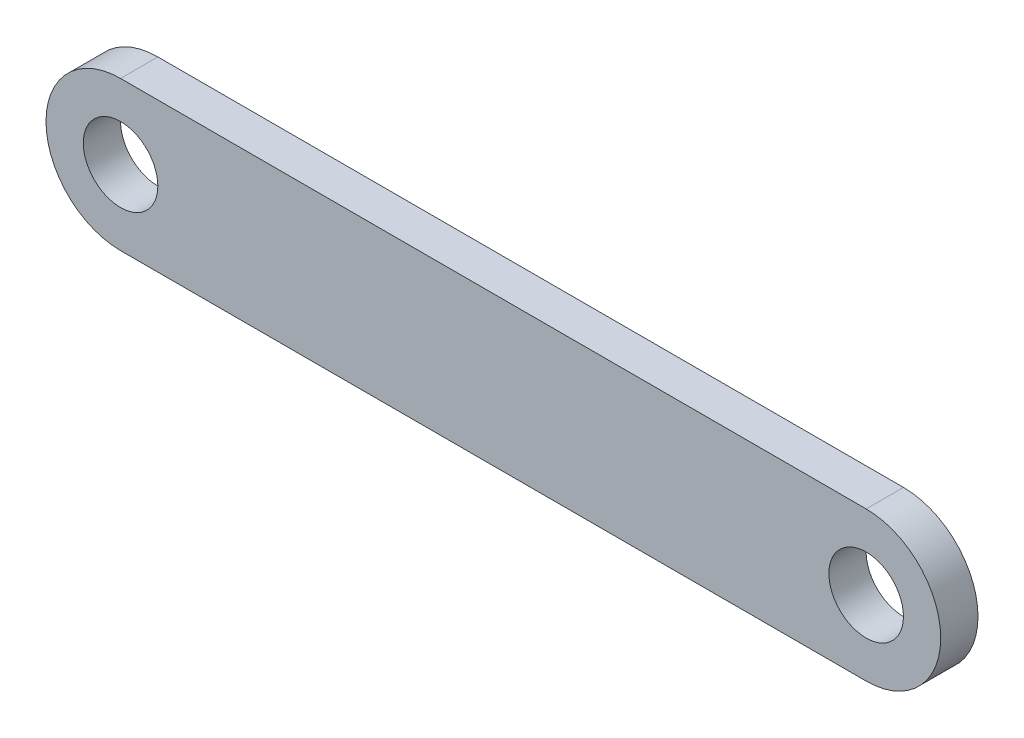
ISO-10303-21;
HEADER;
FILE_DESCRIPTION(('STEP AP214'),'2;1');
FILE_NAME('part.step','',(''),(''),'','','');
FILE_SCHEMA(('AUTOMOTIVE_DESIGN { 1 0 10303 214 1 1 1 1 }'));
ENDSEC;
DATA;
#1=APPLICATION_CONTEXT('core data for automotive mechanical design processes');
#2=APPLICATION_PROTOCOL_DEFINITION('international standard','automotive_design',2000,#1);
#3=PRODUCT_CONTEXT('',#1,'mechanical');
#4=PRODUCT('Part','Part','',(#3));
#5=PRODUCT_RELATED_PRODUCT_CATEGORY('part','',(#4));
#6=PRODUCT_DEFINITION_FORMATION('','',#4);
#7=PRODUCT_DEFINITION_CONTEXT('part definition',#1,'design');
#8=PRODUCT_DEFINITION('design','',#6,#7);
#9=PRODUCT_DEFINITION_SHAPE('','',#8);
#10=(LENGTH_UNIT() NAMED_UNIT(*) SI_UNIT(.MILLI.,.METRE.));
#11=(NAMED_UNIT(*) PLANE_ANGLE_UNIT() SI_UNIT($,.RADIAN.));
#12=(NAMED_UNIT(*) SI_UNIT($,.STERADIAN.) SOLID_ANGLE_UNIT());
#13=UNCERTAINTY_MEASURE_WITH_UNIT(LENGTH_MEASURE(1.E-05),#10,'distance_accuracy_value','');
#14=(GEOMETRIC_REPRESENTATION_CONTEXT(3) GLOBAL_UNCERTAINTY_ASSIGNED_CONTEXT((#13)) GLOBAL_UNIT_ASSIGNED_CONTEXT((#10,
#11,#12)) REPRESENTATION_CONTEXT('',''));
#15=CARTESIAN_POINT('',(0.,0.,0.));
#16=DIRECTION('',(0.,0.,1.));
#17=DIRECTION('',(1.,0.,0.));
#18=AXIS2_PLACEMENT_3D('',#15,#16,#17);
#19=CARTESIAN_POINT('',(-50.,0.,5.));
#20=DIRECTION('',(0.,0.,1.));
#21=DIRECTION('',(1.,0.,0.));
#22=AXIS2_PLACEMENT_3D('',#19,#20,#21);
#23=PLANE('',#22);
#24=CARTESIAN_POINT('',(-50.,0.,5.));
#25=DIRECTION('',(0.,0.,1.));
#26=DIRECTION('',(1.,0.,0.));
#27=AXIS2_PLACEMENT_3D('',#24,#25,#26);
#28=CIRCLE('',#27,5.);
#29=CARTESIAN_POINT('',(-45.,0.,5.));
#30=VERTEX_POINT('',#29);
#31=EDGE_CURVE('E112',#30,#30,#28,.T.);
#32=ORIENTED_EDGE('',*,*,#31,.F.);
#33=EDGE_LOOP('',(#32));
#34=FACE_BOUND('',#33,.T.);
#35=CARTESIAN_POINT('',(-50.,0.,5.));
#36=DIRECTION('',(0.,0.,1.));
#37=DIRECTION('',(1.,0.,0.));
#38=AXIS2_PLACEMENT_3D('',#35,#36,#37);
#39=CIRCLE('',#38,10.);
#40=CARTESIAN_POINT('',(-50.,10.,5.));
#41=VERTEX_POINT('',#40);
#42=CARTESIAN_POINT('',(-50.,-10.,5.));
#43=VERTEX_POINT('',#42);
#44=EDGE_CURVE('E92',#41,#43,#39,.T.);
#45=ORIENTED_EDGE('',*,*,#44,.T.);
#46=DIRECTION('',(1.,0.,0.));
#47=VECTOR('',#46,1.);
#48=CARTESIAN_POINT('',(-50.,-10.,5.));
#49=LINE('',#48,#47);
#50=CARTESIAN_POINT('',(50.,-10.,5.));
#51=VERTEX_POINT('',#50);
#52=EDGE_CURVE('E87',#43,#51,#49,.T.);
#53=ORIENTED_EDGE('',*,*,#52,.T.);
#54=CARTESIAN_POINT('',(50.,0.,5.));
#55=DIRECTION('',(0.,0.,1.));
#56=DIRECTION('',(1.,0.,0.));
#57=AXIS2_PLACEMENT_3D('',#54,#55,#56);
#58=CIRCLE('',#57,10.);
#59=CARTESIAN_POINT('',(50.,10.,5.));
#60=VERTEX_POINT('',#59);
#61=EDGE_CURVE('E90',#51,#60,#58,.T.);
#62=ORIENTED_EDGE('',*,*,#61,.T.);
#63=DIRECTION('',(-1.,0.,0.));
#64=VECTOR('',#63,1.);
#65=CARTESIAN_POINT('',(-50.,10.,5.));
#66=LINE('',#65,#64);
#67=EDGE_CURVE('E57',#60,#41,#66,.T.);
#68=ORIENTED_EDGE('',*,*,#67,.T.);
#69=EDGE_LOOP('',(#45,#53,#62,#68));
#70=FACE_BOUND('',#69,.T.);
#71=CARTESIAN_POINT('',(50.,0.,5.));
#72=DIRECTION('',(0.,0.,1.));
#73=DIRECTION('',(1.,0.,0.));
#74=AXIS2_PLACEMENT_3D('',#71,#72,#73);
#75=CIRCLE('',#74,5.);
#76=CARTESIAN_POINT('',(55.,0.,5.));
#77=VERTEX_POINT('',#76);
#78=EDGE_CURVE('E134',#77,#77,#75,.T.);
#79=ORIENTED_EDGE('',*,*,#78,.F.);
#80=EDGE_LOOP('',(#79));
#81=FACE_BOUND('',#80,.T.);
#82=ADVANCED_FACE('F39',(#34,#70,#81),#23,.T.);
#83=CARTESIAN_POINT('',(-50.,0.,0.));
#84=DIRECTION('',(0.,0.,1.));
#85=DIRECTION('',(1.,0.,0.));
#86=AXIS2_PLACEMENT_3D('',#83,#84,#85);
#87=PLANE('',#86);
#88=CARTESIAN_POINT('',(-50.,0.,0.));
#89=DIRECTION('',(0.,0.,1.));
#90=DIRECTION('',(1.,0.,0.));
#91=AXIS2_PLACEMENT_3D('',#88,#89,#90);
#92=CIRCLE('',#91,10.);
#93=CARTESIAN_POINT('',(-50.,10.,0.));
#94=VERTEX_POINT('',#93);
#95=CARTESIAN_POINT('',(-50.,-10.,0.));
#96=VERTEX_POINT('',#95);
#97=EDGE_CURVE('E108',#94,#96,#92,.T.);
#98=ORIENTED_EDGE('',*,*,#97,.F.);
#99=DIRECTION('',(-1.,0.,0.));
#100=VECTOR('',#99,1.);
#101=CARTESIAN_POINT('',(-50.,10.,0.));
#102=LINE('',#101,#100);
#103=CARTESIAN_POINT('',(50.,10.,0.));
#104=VERTEX_POINT('',#103);
#105=EDGE_CURVE('E80',#104,#94,#102,.T.);
#106=ORIENTED_EDGE('',*,*,#105,.F.);
#107=CARTESIAN_POINT('',(50.,0.,0.));
#108=DIRECTION('',(0.,0.,1.));
#109=DIRECTION('',(1.,0.,0.));
#110=AXIS2_PLACEMENT_3D('',#107,#108,#109);
#111=CIRCLE('',#110,10.);
#112=CARTESIAN_POINT('',(50.,-10.,0.));
#113=VERTEX_POINT('',#112);
#114=EDGE_CURVE('E74',#113,#104,#111,.T.);
#115=ORIENTED_EDGE('',*,*,#114,.F.);
#116=DIRECTION('',(1.,0.,0.));
#117=VECTOR('',#116,1.);
#118=CARTESIAN_POINT('',(-50.,-10.,0.));
#119=LINE('',#118,#117);
#120=EDGE_CURVE('E97',#96,#113,#119,.T.);
#121=ORIENTED_EDGE('',*,*,#120,.F.);
#122=EDGE_LOOP('',(#98,#106,#115,#121));
#123=FACE_BOUND('',#122,.T.);
#124=CARTESIAN_POINT('',(-50.,0.,0.));
#125=DIRECTION('',(0.,0.,1.));
#126=DIRECTION('',(1.,0.,0.));
#127=AXIS2_PLACEMENT_3D('',#124,#125,#126);
#128=CIRCLE('',#127,5.);
#129=CARTESIAN_POINT('',(-45.,0.,0.));
#130=VERTEX_POINT('',#129);
#131=EDGE_CURVE('E130',#130,#130,#128,.T.);
#132=ORIENTED_EDGE('',*,*,#131,.T.);
#133=EDGE_LOOP('',(#132));
#134=FACE_BOUND('',#133,.T.);
#135=CARTESIAN_POINT('',(50.,0.,0.));
#136=DIRECTION('',(0.,0.,1.));
#137=DIRECTION('',(1.,0.,0.));
#138=AXIS2_PLACEMENT_3D('',#135,#136,#137);
#139=CIRCLE('',#138,5.);
#140=CARTESIAN_POINT('',(55.,0.,0.));
#141=VERTEX_POINT('',#140);
#142=EDGE_CURVE('E138',#141,#141,#139,.T.);
#143=ORIENTED_EDGE('',*,*,#142,.T.);
#144=EDGE_LOOP('',(#143));
#145=FACE_BOUND('',#144,.T.);
#146=ADVANCED_FACE('F125',(#123,#134,#145),#87,.F.);
#147=CARTESIAN_POINT('',(-50.,0.,5.));
#148=DIRECTION('',(0.,0.,-1.));
#149=DIRECTION('',(-1.,0.,0.));
#150=AXIS2_PLACEMENT_3D('',#147,#148,#149);
#151=CYLINDRICAL_SURFACE('',#150,10.);
#152=ORIENTED_EDGE('',*,*,#97,.T.);
#153=DIRECTION('',(0.,0.,-1.));
#154=VECTOR('',#153,1.);
#155=CARTESIAN_POINT('',(-50.,-10.,5.));
#156=LINE('',#155,#154);
#157=EDGE_CURVE('E11',#43,#96,#156,.T.);
#158=ORIENTED_EDGE('',*,*,#157,.F.);
#159=ORIENTED_EDGE('',*,*,#44,.F.);
#160=DIRECTION('',(0.,0.,-1.));
#161=VECTOR('',#160,1.);
#162=CARTESIAN_POINT('',(-50.,10.,5.));
#163=LINE('',#162,#161);
#164=EDGE_CURVE('E104',#41,#94,#163,.T.);
#165=ORIENTED_EDGE('',*,*,#164,.T.);
#166=EDGE_LOOP('',(#152,#158,#159,#165));
#167=FACE_BOUND('',#166,.T.);
#168=ADVANCED_FACE('F41',(#167),#151,.T.);
#169=CARTESIAN_POINT('',(-50.,-10.,5.));
#170=DIRECTION('',(0.,1.,0.));
#171=DIRECTION('',(0.,0.,1.));
#172=AXIS2_PLACEMENT_3D('',#169,#170,#171);
#173=PLANE('',#172);
#174=ORIENTED_EDGE('',*,*,#120,.T.);
#175=DIRECTION('',(0.,0.,-1.));
#176=VECTOR('',#175,1.);
#177=CARTESIAN_POINT('',(50.,-10.,5.));
#178=LINE('',#177,#176);
#179=EDGE_CURVE('E49',#51,#113,#178,.T.);
#180=ORIENTED_EDGE('',*,*,#179,.F.);
#181=ORIENTED_EDGE('',*,*,#52,.F.);
#182=ORIENTED_EDGE('',*,*,#157,.T.);
#183=EDGE_LOOP('',(#174,#180,#181,#182));
#184=FACE_BOUND('',#183,.T.);
#185=ADVANCED_FACE('F96',(#184),#173,.F.);
#186=CARTESIAN_POINT('',(50.,0.,5.));
#187=DIRECTION('',(0.,0.,-1.));
#188=DIRECTION('',(-1.,0.,0.));
#189=AXIS2_PLACEMENT_3D('',#186,#187,#188);
#190=CYLINDRICAL_SURFACE('',#189,10.);
#191=ORIENTED_EDGE('',*,*,#114,.T.);
#192=DIRECTION('',(0.,0.,-1.));
#193=VECTOR('',#192,1.);
#194=CARTESIAN_POINT('',(50.,10.,5.));
#195=LINE('',#194,#193);
#196=EDGE_CURVE('E99',#60,#104,#195,.T.);
#197=ORIENTED_EDGE('',*,*,#196,.F.);
#198=ORIENTED_EDGE('',*,*,#61,.F.);
#199=ORIENTED_EDGE('',*,*,#179,.T.);
#200=EDGE_LOOP('',(#191,#197,#198,#199));
#201=FACE_BOUND('',#200,.T.);
#202=ADVANCED_FACE('F100',(#201),#190,.T.);
#203=CARTESIAN_POINT('',(-50.,10.,5.));
#204=DIRECTION('',(0.,-1.,0.));
#205=DIRECTION('',(0.,0.,-1.));
#206=AXIS2_PLACEMENT_3D('',#203,#204,#205);
#207=PLANE('',#206);
#208=ORIENTED_EDGE('',*,*,#105,.T.);
#209=ORIENTED_EDGE('',*,*,#164,.F.);
#210=ORIENTED_EDGE('',*,*,#67,.F.);
#211=ORIENTED_EDGE('',*,*,#196,.T.);
#212=EDGE_LOOP('',(#208,#209,#210,#211));
#213=FACE_BOUND('',#212,.T.);
#214=ADVANCED_FACE('F122',(#213),#207,.F.);
#215=CARTESIAN_POINT('',(-50.,0.,5.));
#216=DIRECTION('',(0.,0.,-1.));
#217=DIRECTION('',(-1.,0.,0.));
#218=AXIS2_PLACEMENT_3D('',#215,#216,#217);
#219=CYLINDRICAL_SURFACE('',#218,5.);
#220=ORIENTED_EDGE('',*,*,#31,.T.);
#221=EDGE_LOOP('',(#220));
#222=FACE_BOUND('',#221,.T.);
#223=ORIENTED_EDGE('',*,*,#131,.F.);
#224=EDGE_LOOP('',(#223));
#225=FACE_BOUND('',#224,.T.);
#226=ADVANCED_FACE('F157',(#222,#225),#219,.F.);
#227=CARTESIAN_POINT('',(50.,0.,5.));
#228=DIRECTION('',(0.,0.,-1.));
#229=DIRECTION('',(-1.,0.,0.));
#230=AXIS2_PLACEMENT_3D('',#227,#228,#229);
#231=CYLINDRICAL_SURFACE('',#230,5.);
#232=ORIENTED_EDGE('',*,*,#78,.T.);
#233=EDGE_LOOP('',(#232));
#234=FACE_BOUND('',#233,.T.);
#235=ORIENTED_EDGE('',*,*,#142,.F.);
#236=EDGE_LOOP('',(#235));
#237=FACE_BOUND('',#236,.T.);
#238=ADVANCED_FACE('F146',(#234,#237),#231,.F.);
#239=CLOSED_SHELL('',(#82,#146,#168,#185,#202,#214,#226,#238));
#240=MANIFOLD_SOLID_BREP('B2',#239);
#241=ADVANCED_BREP_SHAPE_REPRESENTATION('',(#18,#240),#14);
#242=SHAPE_DEFINITION_REPRESENTATION(#9,#241);
ENDSEC;
END-ISO-10303-21;
